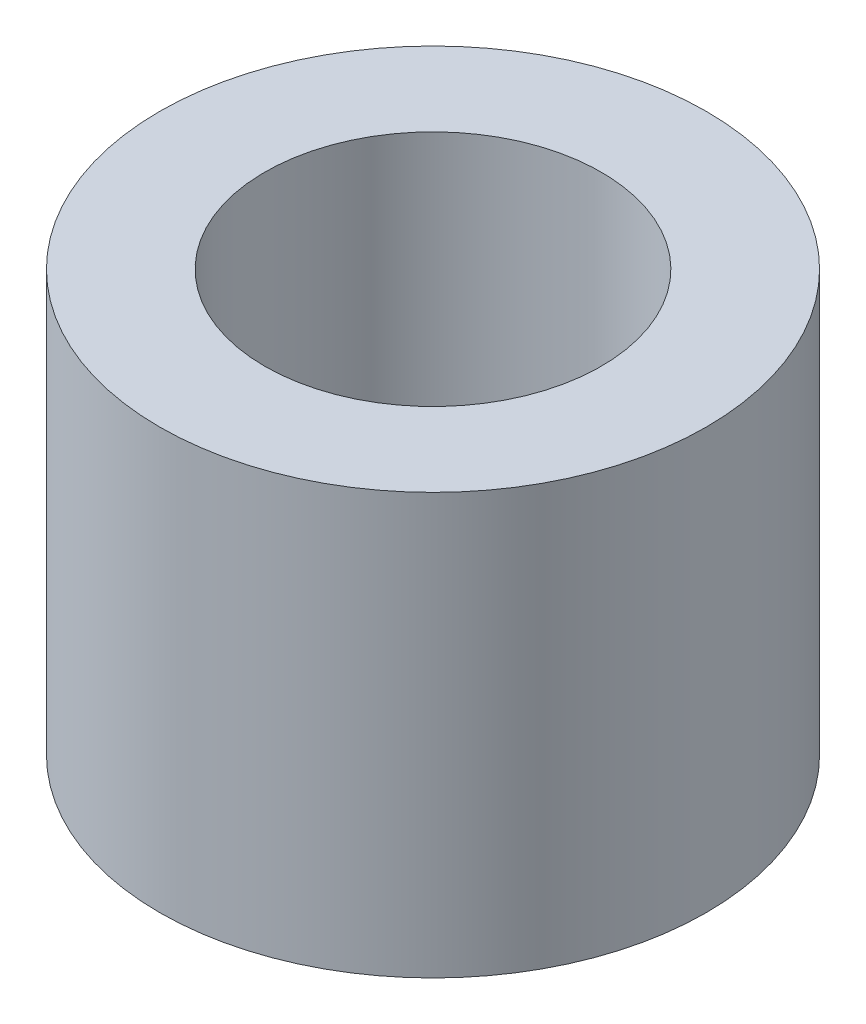
ISO-10303-21;
HEADER;
FILE_DESCRIPTION(('STEP AP214'),'2;1');
FILE_NAME('part.step','',(''),(''),'','','');
FILE_SCHEMA(('AUTOMOTIVE_DESIGN { 1 0 10303 214 1 1 1 1 }'));
ENDSEC;
DATA;
#1=APPLICATION_CONTEXT('core data for automotive mechanical design processes');
#2=APPLICATION_PROTOCOL_DEFINITION('international standard','automotive_design',2000,#1);
#3=PRODUCT_CONTEXT('',#1,'mechanical');
#4=PRODUCT('Part','Part','',(#3));
#5=PRODUCT_RELATED_PRODUCT_CATEGORY('part','',(#4));
#6=PRODUCT_DEFINITION_FORMATION('','',#4);
#7=PRODUCT_DEFINITION_CONTEXT('part definition',#1,'design');
#8=PRODUCT_DEFINITION('design','',#6,#7);
#9=PRODUCT_DEFINITION_SHAPE('','',#8);
#10=(LENGTH_UNIT() NAMED_UNIT(*) SI_UNIT(.MILLI.,.METRE.));
#11=(NAMED_UNIT(*) PLANE_ANGLE_UNIT() SI_UNIT($,.RADIAN.));
#12=(NAMED_UNIT(*) SI_UNIT($,.STERADIAN.) SOLID_ANGLE_UNIT());
#13=UNCERTAINTY_MEASURE_WITH_UNIT(LENGTH_MEASURE(1.E-05),#10,'distance_accuracy_value','');
#14=(GEOMETRIC_REPRESENTATION_CONTEXT(3) GLOBAL_UNCERTAINTY_ASSIGNED_CONTEXT((#13)) GLOBAL_UNIT_ASSIGNED_CONTEXT((#10,
#11,#12)) REPRESENTATION_CONTEXT('',''));
#15=CARTESIAN_POINT('',(0.,0.,0.));
#16=DIRECTION('',(0.,0.,1.));
#17=DIRECTION('',(1.,0.,0.));
#18=AXIS2_PLACEMENT_3D('',#15,#16,#17);
#19=CARTESIAN_POINT('',(0.,4.,0.));
#20=DIRECTION('',(0.,1.,0.));
#21=DIRECTION('',(0.,0.,1.));
#22=AXIS2_PLACEMENT_3D('',#19,#20,#21);
#23=PLANE('',#22);
#24=CARTESIAN_POINT('',(0.,4.,0.));
#25=DIRECTION('',(0.,1.,0.));
#26=DIRECTION('',(0.,0.,1.));
#27=AXIS2_PLACEMENT_3D('',#24,#25,#26);
#28=CIRCLE('',#27,2.6);
#29=CARTESIAN_POINT('',(0.,4.,2.6));
#30=VERTEX_POINT('',#29);
#31=EDGE_CURVE('E10',#30,#30,#28,.T.);
#32=ORIENTED_EDGE('',*,*,#31,.T.);
#33=EDGE_LOOP('',(#32));
#34=FACE_BOUND('',#33,.T.);
#35=CARTESIAN_POINT('',(0.,4.,0.));
#36=DIRECTION('',(0.,1.,0.));
#37=DIRECTION('',(0.,0.,1.));
#38=AXIS2_PLACEMENT_3D('',#35,#36,#37);
#39=CIRCLE('',#38,1.6);
#40=CARTESIAN_POINT('',(0.,4.,1.6));
#41=VERTEX_POINT('',#40);
#42=EDGE_CURVE('E42',#41,#41,#39,.T.);
#43=ORIENTED_EDGE('',*,*,#42,.F.);
#44=EDGE_LOOP('',(#43));
#45=FACE_BOUND('',#44,.T.);
#46=ADVANCED_FACE('F31',(#34,#45),#23,.T.);
#47=CARTESIAN_POINT('',(0.,0.,0.));
#48=DIRECTION('',(0.,1.,0.));
#49=DIRECTION('',(0.,0.,1.));
#50=AXIS2_PLACEMENT_3D('',#47,#48,#49);
#51=PLANE('',#50);
#52=CARTESIAN_POINT('',(0.,0.,0.));
#53=DIRECTION('',(0.,1.,0.));
#54=DIRECTION('',(0.,0.,1.));
#55=AXIS2_PLACEMENT_3D('',#52,#53,#54);
#56=CIRCLE('',#55,2.6);
#57=CARTESIAN_POINT('',(0.,0.,2.6));
#58=VERTEX_POINT('',#57);
#59=EDGE_CURVE('E35',#58,#58,#56,.T.);
#60=ORIENTED_EDGE('',*,*,#59,.F.);
#61=EDGE_LOOP('',(#60));
#62=FACE_BOUND('',#61,.T.);
#63=CARTESIAN_POINT('',(0.,0.,0.));
#64=DIRECTION('',(0.,1.,0.));
#65=DIRECTION('',(0.,0.,1.));
#66=AXIS2_PLACEMENT_3D('',#63,#64,#65);
#67=CIRCLE('',#66,1.6);
#68=CARTESIAN_POINT('',(0.,0.,1.6));
#69=VERTEX_POINT('',#68);
#70=EDGE_CURVE('E44',#69,#69,#67,.T.);
#71=ORIENTED_EDGE('',*,*,#70,.T.);
#72=EDGE_LOOP('',(#71));
#73=FACE_BOUND('',#72,.T.);
#74=ADVANCED_FACE('F54',(#62,#73),#51,.F.);
#75=CARTESIAN_POINT('',(0.,4.,0.));
#76=DIRECTION('',(0.,-1.,0.));
#77=DIRECTION('',(0.,0.,-1.));
#78=AXIS2_PLACEMENT_3D('',#75,#76,#77);
#79=CYLINDRICAL_SURFACE('',#78,2.6);
#80=ORIENTED_EDGE('',*,*,#31,.F.);
#81=EDGE_LOOP('',(#80));
#82=FACE_BOUND('',#81,.T.);
#83=ORIENTED_EDGE('',*,*,#59,.T.);
#84=EDGE_LOOP('',(#83));
#85=FACE_BOUND('',#84,.T.);
#86=ADVANCED_FACE('F33',(#82,#85),#79,.T.);
#87=CARTESIAN_POINT('',(0.,4.,0.));
#88=DIRECTION('',(0.,-1.,0.));
#89=DIRECTION('',(0.,0.,-1.));
#90=AXIS2_PLACEMENT_3D('',#87,#88,#89);
#91=CYLINDRICAL_SURFACE('',#90,1.6);
#92=ORIENTED_EDGE('',*,*,#42,.T.);
#93=EDGE_LOOP('',(#92));
#94=FACE_BOUND('',#93,.T.);
#95=ORIENTED_EDGE('',*,*,#70,.F.);
#96=EDGE_LOOP('',(#95));
#97=FACE_BOUND('',#96,.T.);
#98=ADVANCED_FACE('F50',(#94,#97),#91,.F.);
#99=CLOSED_SHELL('',(#46,#74,#86,#98));
#100=MANIFOLD_SOLID_BREP('B2',#99);
#101=ADVANCED_BREP_SHAPE_REPRESENTATION('',(#18,#100),#14);
#102=SHAPE_DEFINITION_REPRESENTATION(#9,#101);
ENDSEC;
END-ISO-10303-21;
